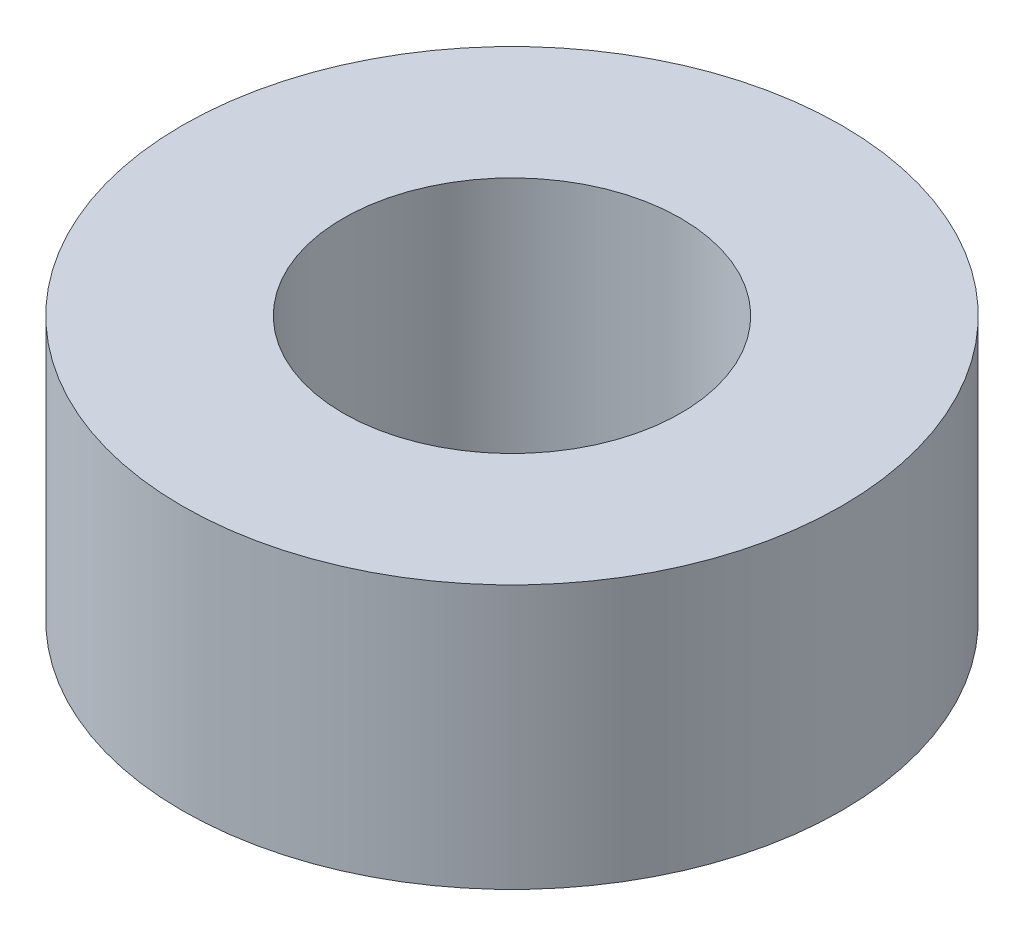
ISO-10303-21;
HEADER;
FILE_DESCRIPTION(('STEP AP214'),'2;1');
FILE_NAME('part.step','',(''),(''),'','','');
FILE_SCHEMA(('AUTOMOTIVE_DESIGN { 1 0 10303 214 1 1 1 1 }'));
ENDSEC;
DATA;
#1=APPLICATION_CONTEXT('core data for automotive mechanical design processes');
#2=APPLICATION_PROTOCOL_DEFINITION('international standard','automotive_design',2000,#1);
#3=PRODUCT_CONTEXT('',#1,'mechanical');
#4=PRODUCT('Part','Part','',(#3));
#5=PRODUCT_RELATED_PRODUCT_CATEGORY('part','',(#4));
#6=PRODUCT_DEFINITION_FORMATION('','',#4);
#7=PRODUCT_DEFINITION_CONTEXT('part definition',#1,'design');
#8=PRODUCT_DEFINITION('design','',#6,#7);
#9=PRODUCT_DEFINITION_SHAPE('','',#8);
#10=(LENGTH_UNIT() NAMED_UNIT(*) SI_UNIT(.MILLI.,.METRE.));
#11=(NAMED_UNIT(*) PLANE_ANGLE_UNIT() SI_UNIT($,.RADIAN.));
#12=(NAMED_UNIT(*) SI_UNIT($,.STERADIAN.) SOLID_ANGLE_UNIT());
#13=UNCERTAINTY_MEASURE_WITH_UNIT(LENGTH_MEASURE(1.E-05),#10,'distance_accuracy_value','');
#14=(GEOMETRIC_REPRESENTATION_CONTEXT(3) GLOBAL_UNCERTAINTY_ASSIGNED_CONTEXT((#13)) GLOBAL_UNIT_ASSIGNED_CONTEXT((#10,
#11,#12)) REPRESENTATION_CONTEXT('',''));
#15=CARTESIAN_POINT('',(0.,0.,0.));
#16=DIRECTION('',(0.,0.,1.));
#17=DIRECTION('',(1.,0.,0.));
#18=AXIS2_PLACEMENT_3D('',#15,#16,#17);
#19=CARTESIAN_POINT('',(0.,-3.175,0.));
#20=DIRECTION('',(0.,1.,0.));
#21=DIRECTION('',(0.,0.,1.));
#22=AXIS2_PLACEMENT_3D('',#19,#20,#21);
#23=CYLINDRICAL_SURFACE('',#22,4.064);
#24=CARTESIAN_POINT('',(0.,3.175,0.));
#25=DIRECTION('',(0.,1.,0.));
#26=DIRECTION('',(0.,0.,1.));
#27=AXIS2_PLACEMENT_3D('',#24,#25,#26);
#28=CIRCLE('',#27,4.064);
#29=CARTESIAN_POINT('',(0.,3.175,4.064));
#30=VERTEX_POINT('',#29);
#31=EDGE_CURVE('E18',#30,#30,#28,.F.);
#32=ORIENTED_EDGE('',*,*,#31,.F.);
#33=EDGE_LOOP('',(#32));
#34=FACE_BOUND('',#33,.T.);
#35=CARTESIAN_POINT('',(0.,-3.175,0.));
#36=DIRECTION('',(0.,1.,0.));
#37=DIRECTION('',(0.,0.,1.));
#38=AXIS2_PLACEMENT_3D('',#35,#36,#37);
#39=CIRCLE('',#38,4.064);
#40=CARTESIAN_POINT('',(0.,-3.175,4.064));
#41=VERTEX_POINT('',#40);
#42=EDGE_CURVE('E27',#41,#41,#39,.F.);
#43=ORIENTED_EDGE('',*,*,#42,.T.);
#44=EDGE_LOOP('',(#43));
#45=FACE_BOUND('',#44,.T.);
#46=ADVANCED_FACE('F15',(#34,#45),#23,.F.);
#47=CARTESIAN_POINT('',(0.,3.175,0.));
#48=DIRECTION('',(0.,1.,0.));
#49=DIRECTION('',(0.,0.,1.));
#50=AXIS2_PLACEMENT_3D('',#47,#48,#49);
#51=PLANE('',#50);
#52=ORIENTED_EDGE('',*,*,#31,.T.);
#53=EDGE_LOOP('',(#52));
#54=FACE_BOUND('',#53,.T.);
#55=CARTESIAN_POINT('',(0.,3.175,0.));
#56=DIRECTION('',(0.,1.,0.));
#57=DIRECTION('',(0.,0.,1.));
#58=AXIS2_PLACEMENT_3D('',#55,#56,#57);
#59=CIRCLE('',#58,7.9375);
#60=CARTESIAN_POINT('',(0.,3.175,7.9375));
#61=VERTEX_POINT('',#60);
#62=EDGE_CURVE('E22',#61,#61,#59,.F.);
#63=ORIENTED_EDGE('',*,*,#62,.F.);
#64=EDGE_LOOP('',(#63));
#65=FACE_BOUND('',#64,.T.);
#66=ADVANCED_FACE('F35',(#54,#65),#51,.T.);
#67=CARTESIAN_POINT('',(0.,-3.175,0.));
#68=DIRECTION('',(0.,1.,0.));
#69=DIRECTION('',(0.,0.,1.));
#70=AXIS2_PLACEMENT_3D('',#67,#68,#69);
#71=PLANE('',#70);
#72=ORIENTED_EDGE('',*,*,#42,.F.);
#73=EDGE_LOOP('',(#72));
#74=FACE_BOUND('',#73,.T.);
#75=CARTESIAN_POINT('',(0.,-3.175,0.));
#76=DIRECTION('',(0.,1.,0.));
#77=DIRECTION('',(0.,0.,1.));
#78=AXIS2_PLACEMENT_3D('',#75,#76,#77);
#79=CIRCLE('',#78,7.9375);
#80=CARTESIAN_POINT('',(0.,-3.175,7.9375));
#81=VERTEX_POINT('',#80);
#82=EDGE_CURVE('E10',#81,#81,#79,.T.);
#83=ORIENTED_EDGE('',*,*,#82,.F.);
#84=EDGE_LOOP('',(#83));
#85=FACE_BOUND('',#84,.T.);
#86=ADVANCED_FACE('F43',(#74,#85),#71,.F.);
#87=CARTESIAN_POINT('',(0.,-3.175,0.));
#88=DIRECTION('',(0.,1.,0.));
#89=DIRECTION('',(0.,0.,1.));
#90=AXIS2_PLACEMENT_3D('',#87,#88,#89);
#91=CYLINDRICAL_SURFACE('',#90,7.9375);
#92=ORIENTED_EDGE('',*,*,#62,.T.);
#93=EDGE_LOOP('',(#92));
#94=FACE_BOUND('',#93,.T.);
#95=ORIENTED_EDGE('',*,*,#82,.T.);
#96=EDGE_LOOP('',(#95));
#97=FACE_BOUND('',#96,.T.);
#98=ADVANCED_FACE('F44',(#94,#97),#91,.T.);
#99=CLOSED_SHELL('',(#46,#66,#86,#98));
#100=MANIFOLD_SOLID_BREP('B1',#99);
#101=ADVANCED_BREP_SHAPE_REPRESENTATION('',(#18,#100),#14);
#102=SHAPE_DEFINITION_REPRESENTATION(#9,#101);
ENDSEC;
END-ISO-10303-21;
